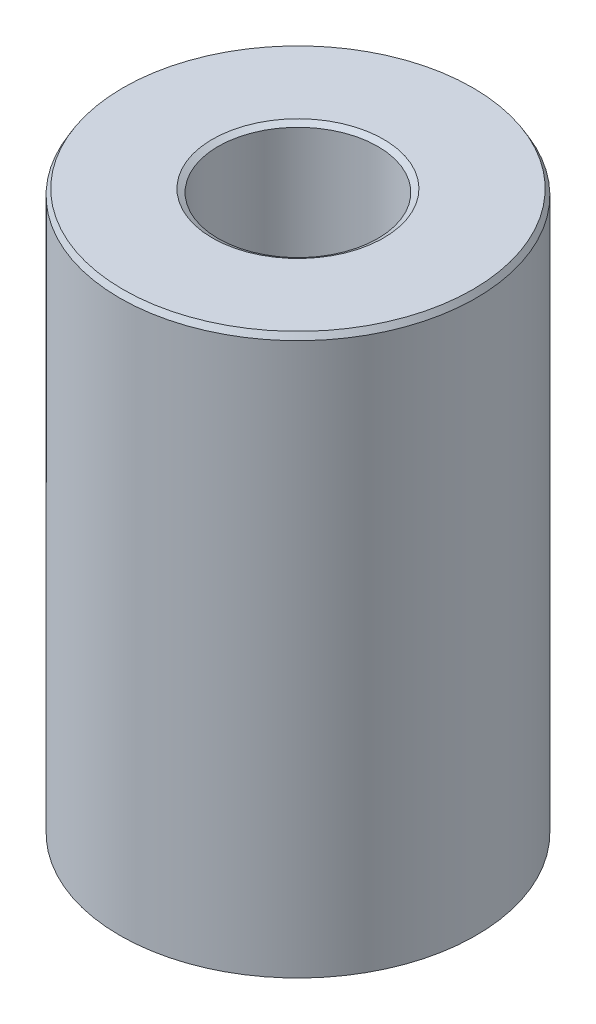
ISO-10303-21;
HEADER;
FILE_DESCRIPTION(('STEP AP214'),'2;1');
FILE_NAME('part.step','',(''),(''),'','','');
FILE_SCHEMA(('AUTOMOTIVE_DESIGN { 1 0 10303 214 1 1 1 1 }'));
ENDSEC;
DATA;
#1=APPLICATION_CONTEXT('core data for automotive mechanical design processes');
#2=APPLICATION_PROTOCOL_DEFINITION('international standard','automotive_design',2000,#1);
#3=PRODUCT_CONTEXT('',#1,'mechanical');
#4=PRODUCT('Part','Part','',(#3));
#5=PRODUCT_RELATED_PRODUCT_CATEGORY('part','',(#4));
#6=PRODUCT_DEFINITION_FORMATION('','',#4);
#7=PRODUCT_DEFINITION_CONTEXT('part definition',#1,'design');
#8=PRODUCT_DEFINITION('design','',#6,#7);
#9=PRODUCT_DEFINITION_SHAPE('','',#8);
#10=(LENGTH_UNIT() NAMED_UNIT(*) SI_UNIT(.MILLI.,.METRE.));
#11=(NAMED_UNIT(*) PLANE_ANGLE_UNIT() SI_UNIT($,.RADIAN.));
#12=(NAMED_UNIT(*) SI_UNIT($,.STERADIAN.) SOLID_ANGLE_UNIT());
#13=UNCERTAINTY_MEASURE_WITH_UNIT(LENGTH_MEASURE(1.E-05),#10,'distance_accuracy_value','');
#14=(GEOMETRIC_REPRESENTATION_CONTEXT(3) GLOBAL_UNCERTAINTY_ASSIGNED_CONTEXT((#13)) GLOBAL_UNIT_ASSIGNED_CONTEXT((#10,
#11,#12)) REPRESENTATION_CONTEXT('',''));
#15=CARTESIAN_POINT('',(0.,0.,0.));
#16=DIRECTION('',(0.,0.,1.));
#17=DIRECTION('',(1.,0.,0.));
#18=AXIS2_PLACEMENT_3D('',#15,#16,#17);
#19=CARTESIAN_POINT('',(0.,173.21491433764,0.));
#20=DIRECTION('',(0.,-1.,0.));
#21=DIRECTION('',(0.,0.,-1.));
#22=AXIS2_PLACEMENT_3D('',#19,#20,#21);
#23=CYLINDRICAL_SURFACE('',#22,55.);
#24=CARTESIAN_POINT('',(0.,1.02473465638966,0.));
#25=DIRECTION('',(0.,1.,0.));
#26=DIRECTION('',(0.,0.,1.));
#27=AXIS2_PLACEMENT_3D('',#24,#25,#26);
#28=CIRCLE('',#27,55.);
#29=CARTESIAN_POINT('',(0.,1.02473465638966,55.));
#30=VERTEX_POINT('',#29);
#31=EDGE_CURVE('E10',#30,#30,#28,.T.);
#32=ORIENTED_EDGE('',*,*,#31,.T.);
#33=EDGE_LOOP('',(#32));
#34=FACE_BOUND('',#33,.T.);
#35=CARTESIAN_POINT('',(0.,171.440021848496,0.));
#36=DIRECTION('',(0.,1.,0.));
#37=DIRECTION('',(0.,0.,1.));
#38=AXIS2_PLACEMENT_3D('',#35,#36,#37);
#39=CIRCLE('',#38,55.);
#40=CARTESIAN_POINT('',(0.,171.440021848496,55.));
#41=VERTEX_POINT('',#40);
#42=EDGE_CURVE('E50',#41,#41,#39,.F.);
#43=ORIENTED_EDGE('',*,*,#42,.T.);
#44=EDGE_LOOP('',(#43));
#45=FACE_BOUND('',#44,.T.);
#46=ADVANCED_FACE('F39',(#34,#45),#23,.T.);
#47=CARTESIAN_POINT('',(0.,173.21491433764,0.));
#48=DIRECTION('',(0.,1.,0.));
#49=DIRECTION('',(0.,0.,1.));
#50=AXIS2_PLACEMENT_3D('',#47,#48,#49);
#51=PLANE('',#50);
#52=CARTESIAN_POINT('',(0.,173.21491433764,0.));
#53=DIRECTION('',(0.,1.,0.));
#54=DIRECTION('',(0.,0.,1.));
#55=AXIS2_PLACEMENT_3D('',#52,#53,#54);
#56=CIRCLE('',#55,26.4237793092466);
#57=CARTESIAN_POINT('',(0.,173.21491433764,26.4237793092466));
#58=VERTEX_POINT('',#57);
#59=EDGE_CURVE('E58',#58,#58,#56,.F.);
#60=ORIENTED_EDGE('',*,*,#59,.T.);
#61=EDGE_LOOP('',(#60));
#62=FACE_BOUND('',#61,.T.);
#63=CARTESIAN_POINT('',(0.,173.21491433764,0.));
#64=DIRECTION('',(0.,1.,0.));
#65=DIRECTION('',(0.,0.,1.));
#66=AXIS2_PLACEMENT_3D('',#63,#64,#65);
#67=CIRCLE('',#66,53.9752653436103);
#68=CARTESIAN_POINT('',(0.,173.21491433764,53.9752653436103));
#69=VERTEX_POINT('',#68);
#70=EDGE_CURVE('E61',#69,#69,#67,.T.);
#71=ORIENTED_EDGE('',*,*,#70,.T.);
#72=EDGE_LOOP('',(#71));
#73=FACE_BOUND('',#72,.T.);
#74=ADVANCED_FACE('F88',(#62,#73),#51,.T.);
#75=CARTESIAN_POINT('',(0.,0.,0.));
#76=DIRECTION('',(0.,1.,0.));
#77=DIRECTION('',(0.,0.,1.));
#78=AXIS2_PLACEMENT_3D('',#75,#76,#77);
#79=PLANE('',#78);
#80=CARTESIAN_POINT('',(0.,0.,0.));
#81=DIRECTION('',(0.,1.,0.));
#82=DIRECTION('',(0.,0.,1.));
#83=AXIS2_PLACEMENT_3D('',#80,#81,#82);
#84=CIRCLE('',#83,25.6736214764928);
#85=CARTESIAN_POINT('',(0.,0.,25.6736214764928));
#86=VERTEX_POINT('',#85);
#87=EDGE_CURVE('E51',#86,#86,#84,.T.);
#88=ORIENTED_EDGE('',*,*,#87,.T.);
#89=EDGE_LOOP('',(#88));
#90=FACE_BOUND('',#89,.T.);
#91=CARTESIAN_POINT('',(0.,0.,0.));
#92=DIRECTION('',(0.,1.,0.));
#93=DIRECTION('',(0.,0.,1.));
#94=AXIS2_PLACEMENT_3D('',#91,#92,#93);
#95=CIRCLE('',#94,53.2251075108564);
#96=CARTESIAN_POINT('',(0.,0.,53.2251075108564));
#97=VERTEX_POINT('',#96);
#98=EDGE_CURVE('E54',#97,#97,#95,.F.);
#99=ORIENTED_EDGE('',*,*,#98,.T.);
#100=EDGE_LOOP('',(#99));
#101=FACE_BOUND('',#100,.T.);
#102=ADVANCED_FACE('F83',(#90,#101),#79,.F.);
#103=CARTESIAN_POINT('',(0.,173.21491433764,0.));
#104=DIRECTION('',(0.,-1.,0.));
#105=DIRECTION('',(0.,0.,-1.));
#106=AXIS2_PLACEMENT_3D('',#103,#104,#105);
#107=CYLINDRICAL_SURFACE('',#106,24.6488868201031);
#108=CARTESIAN_POINT('',(0.,172.19017968125,0.));
#109=DIRECTION('',(0.,1.,0.));
#110=DIRECTION('',(0.,0.,1.));
#111=AXIS2_PLACEMENT_3D('',#108,#109,#110);
#112=CIRCLE('',#111,24.6488868201031);
#113=CARTESIAN_POINT('',(0.,172.19017968125,24.6488868201031));
#114=VERTEX_POINT('',#113);
#115=EDGE_CURVE('E67',#114,#114,#112,.T.);
#116=ORIENTED_EDGE('',*,*,#115,.T.);
#117=EDGE_LOOP('',(#116));
#118=FACE_BOUND('',#117,.T.);
#119=CARTESIAN_POINT('',(0.,1.77489248914359,0.));
#120=DIRECTION('',(0.,1.,0.));
#121=DIRECTION('',(0.,0.,1.));
#122=AXIS2_PLACEMENT_3D('',#119,#120,#121);
#123=CIRCLE('',#122,24.6488868201031);
#124=CARTESIAN_POINT('',(0.,1.77489248914359,24.6488868201031));
#125=VERTEX_POINT('',#124);
#126=EDGE_CURVE('E69',#125,#125,#123,.F.);
#127=ORIENTED_EDGE('',*,*,#126,.T.);
#128=EDGE_LOOP('',(#127));
#129=FACE_BOUND('',#128,.T.);
#130=ADVANCED_FACE('F71',(#118,#129),#107,.F.);
#131=CARTESIAN_POINT('',(0.,172.19017968125,0.));
#132=DIRECTION('',(0.,1.,0.));
#133=DIRECTION('',(0.,0.,1.));
#134=AXIS2_PLACEMENT_3D('',#131,#132,#133);
#135=CONICAL_SURFACE('',#134,24.6488868201031,1.0471975511966);
#136=ORIENTED_EDGE('',*,*,#59,.F.);
#137=EDGE_LOOP('',(#136));
#138=FACE_BOUND('',#137,.T.);
#139=ORIENTED_EDGE('',*,*,#115,.F.);
#140=EDGE_LOOP('',(#139));
#141=FACE_BOUND('',#140,.T.);
#142=ADVANCED_FACE('F77',(#138,#141),#135,.F.);
#143=CARTESIAN_POINT('',(0.,0.,0.));
#144=DIRECTION('',(0.,-1.,0.));
#145=DIRECTION('',(0.,0.,-1.));
#146=AXIS2_PLACEMENT_3D('',#143,#144,#145);
#147=CONICAL_SURFACE('',#146,25.6736214764928,0.523598775598293);
#148=ORIENTED_EDGE('',*,*,#126,.F.);
#149=EDGE_LOOP('',(#148));
#150=FACE_BOUND('',#149,.T.);
#151=ORIENTED_EDGE('',*,*,#87,.F.);
#152=EDGE_LOOP('',(#151));
#153=FACE_BOUND('',#152,.T.);
#154=ADVANCED_FACE('F73',(#150,#153),#147,.F.);
#155=CARTESIAN_POINT('',(0.,1.02473465638966,0.));
#156=DIRECTION('',(0.,1.,0.));
#157=DIRECTION('',(0.,0.,1.));
#158=AXIS2_PLACEMENT_3D('',#155,#156,#157);
#159=CONICAL_SURFACE('',#158,55.,1.04719755119661);
#160=ORIENTED_EDGE('',*,*,#98,.F.);
#161=EDGE_LOOP('',(#160));
#162=FACE_BOUND('',#161,.T.);
#163=ORIENTED_EDGE('',*,*,#31,.F.);
#164=EDGE_LOOP('',(#163));
#165=FACE_BOUND('',#164,.T.);
#166=ADVANCED_FACE('F76',(#162,#165),#159,.T.);
#167=CARTESIAN_POINT('',(0.,173.21491433764,0.));
#168=DIRECTION('',(0.,-1.,0.));
#169=DIRECTION('',(0.,0.,-1.));
#170=AXIS2_PLACEMENT_3D('',#167,#168,#169);
#171=CONICAL_SURFACE('',#170,53.9752653436103,0.523598775598297);
#172=ORIENTED_EDGE('',*,*,#42,.F.);
#173=EDGE_LOOP('',(#172));
#174=FACE_BOUND('',#173,.T.);
#175=ORIENTED_EDGE('',*,*,#70,.F.);
#176=EDGE_LOOP('',(#175));
#177=FACE_BOUND('',#176,.T.);
#178=ADVANCED_FACE('F45',(#174,#177),#171,.T.);
#179=CLOSED_SHELL('',(#46,#74,#102,#130,#142,#154,#166,#178));
#180=MANIFOLD_SOLID_BREP('B2',#179);
#181=ADVANCED_BREP_SHAPE_REPRESENTATION('',(#18,#180),#14);
#182=SHAPE_DEFINITION_REPRESENTATION(#9,#181);
ENDSEC;
END-ISO-10303-21;
